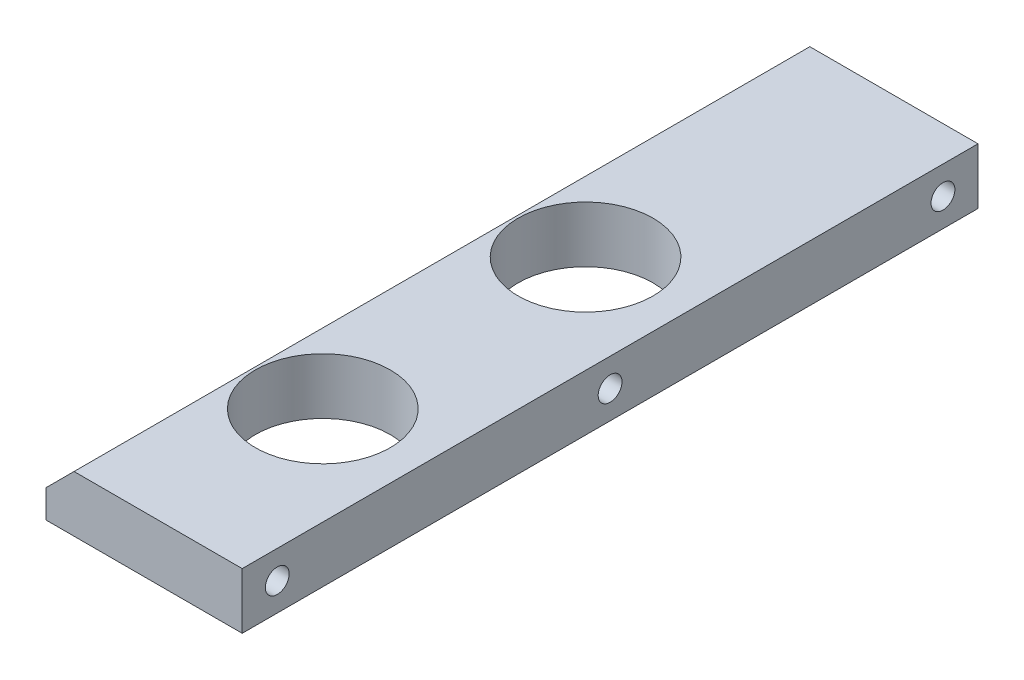
ISO-10303-21;
HEADER;
FILE_DESCRIPTION(('STEP AP214'),'2;1');
FILE_NAME('part.step','',(''),(''),'','','');
FILE_SCHEMA(('AUTOMOTIVE_DESIGN { 1 0 10303 214 1 1 1 1 }'));
ENDSEC;
DATA;
#1=APPLICATION_CONTEXT('core data for automotive mechanical design processes');
#2=APPLICATION_PROTOCOL_DEFINITION('international standard','automotive_design',2000,#1);
#3=PRODUCT_CONTEXT('',#1,'mechanical');
#4=PRODUCT('Part','Part','',(#3));
#5=PRODUCT_RELATED_PRODUCT_CATEGORY('part','',(#4));
#6=PRODUCT_DEFINITION_FORMATION('','',#4);
#7=PRODUCT_DEFINITION_CONTEXT('part definition',#1,'design');
#8=PRODUCT_DEFINITION('design','',#6,#7);
#9=PRODUCT_DEFINITION_SHAPE('','',#8);
#10=(LENGTH_UNIT() NAMED_UNIT(*) SI_UNIT(.MILLI.,.METRE.));
#11=(NAMED_UNIT(*) PLANE_ANGLE_UNIT() SI_UNIT($,.RADIAN.));
#12=(NAMED_UNIT(*) SI_UNIT($,.STERADIAN.) SOLID_ANGLE_UNIT());
#13=UNCERTAINTY_MEASURE_WITH_UNIT(LENGTH_MEASURE(1.E-05),#10,'distance_accuracy_value','');
#14=(GEOMETRIC_REPRESENTATION_CONTEXT(3) GLOBAL_UNCERTAINTY_ASSIGNED_CONTEXT((#13)) GLOBAL_UNIT_ASSIGNED_CONTEXT((#10,
#11,#12)) REPRESENTATION_CONTEXT('',''));
#15=CARTESIAN_POINT('',(0.,0.,0.));
#16=DIRECTION('',(0.,0.,1.));
#17=DIRECTION('',(1.,0.,0.));
#18=AXIS2_PLACEMENT_3D('',#15,#16,#17);
#19=CARTESIAN_POINT('',(13.0000000000337,8.,-95.));
#20=DIRECTION('',(1.,0.,0.));
#21=DIRECTION('',(0.,1.,0.));
#22=AXIS2_PLACEMENT_3D('',#19,#20,#21);
#23=CONICAL_SURFACE('',#22,3.3999999999719,1.02974425866659);
#24=CARTESIAN_POINT('',(10.9570738953551,7.99999999995293,-95.));
#25=VERTEX_POINT('',#24);
#26=VERTEX_LOOP('',#25);
#27=FACE_BOUND('',#26,.T.);
#28=CARTESIAN_POINT('',(13.,8.,-95.));
#29=DIRECTION('',(1.,0.,0.));
#30=DIRECTION('',(0.,0.,-1.));
#31=AXIS2_PLACEMENT_3D('',#28,#29,#30);
#32=CIRCLE('',#31,3.4);
#33=CARTESIAN_POINT('',(13.,8.,-98.4));
#34=VERTEX_POINT('',#33);
#35=EDGE_CURVE('E93',#34,#34,#32,.T.);
#36=ORIENTED_EDGE('',*,*,#35,.T.);
#37=EDGE_LOOP('',(#36));
#38=FACE_BOUND('',#37,.T.);
#39=ADVANCED_FACE('F17',(#27,#38),#23,.F.);
#40=CARTESIAN_POINT('',(12.9999999998631,8.,0.));
#41=DIRECTION('',(1.,0.,0.));
#42=DIRECTION('',(0.,1.,0.));
#43=AXIS2_PLACEMENT_3D('',#40,#41,#42);
#44=CONICAL_SURFACE('',#43,3.39999999982865,1.02974425858268);
#45=CARTESIAN_POINT('',(10.9570738951561,7.9999999997824,0.));
#46=VERTEX_POINT('',#45);
#47=VERTEX_LOOP('',#46);
#48=FACE_BOUND('',#47,.T.);
#49=CARTESIAN_POINT('',(13.,8.,0.));
#50=DIRECTION('',(1.,0.,0.));
#51=DIRECTION('',(0.,0.,-1.));
#52=AXIS2_PLACEMENT_3D('',#49,#50,#51);
#53=CIRCLE('',#52,3.4);
#54=CARTESIAN_POINT('',(13.,8.,-3.4));
#55=VERTEX_POINT('',#54);
#56=EDGE_CURVE('E95',#55,#55,#53,.T.);
#57=ORIENTED_EDGE('',*,*,#56,.T.);
#58=EDGE_LOOP('',(#57));
#59=FACE_BOUND('',#58,.T.);
#60=ADVANCED_FACE('F90',(#48,#59),#44,.F.);
#61=CARTESIAN_POINT('',(13.0000000000337,8.,95.));
#62=DIRECTION('',(1.,0.,0.));
#63=DIRECTION('',(0.,1.,0.));
#64=AXIS2_PLACEMENT_3D('',#61,#62,#63);
#65=CONICAL_SURFACE('',#64,3.39999999996962,1.02974425866599);
#66=CARTESIAN_POINT('',(10.9570738953266,8.00000000000978,95.));
#67=VERTEX_POINT('',#66);
#68=VERTEX_LOOP('',#67);
#69=FACE_BOUND('',#68,.T.);
#70=CARTESIAN_POINT('',(13.,8.,95.));
#71=DIRECTION('',(1.,0.,0.));
#72=DIRECTION('',(0.,0.,-1.));
#73=AXIS2_PLACEMENT_3D('',#70,#71,#72);
#74=CIRCLE('',#73,3.4);
#75=CARTESIAN_POINT('',(13.,8.,91.6));
#76=VERTEX_POINT('',#75);
#77=EDGE_CURVE('E98',#76,#76,#74,.T.);
#78=ORIENTED_EDGE('',*,*,#77,.T.);
#79=EDGE_LOOP('',(#78));
#80=FACE_BOUND('',#79,.T.);
#81=ADVANCED_FACE('F205',(#69,#80),#65,.F.);
#82=CARTESIAN_POINT('',(10.1049275901,8.,-95.));
#83=DIRECTION('',(1.,0.,0.));
#84=DIRECTION('',(0.,0.,-1.));
#85=AXIS2_PLACEMENT_3D('',#82,#83,#84);
#86=CYLINDRICAL_SURFACE('',#85,3.4);
#87=ORIENTED_EDGE('',*,*,#35,.F.);
#88=EDGE_LOOP('',(#87));
#89=FACE_BOUND('',#88,.T.);
#90=CARTESIAN_POINT('',(28.,8.,-95.));
#91=DIRECTION('',(1.,0.,0.));
#92=DIRECTION('',(0.,0.,-1.));
#93=AXIS2_PLACEMENT_3D('',#90,#91,#92);
#94=CIRCLE('',#93,3.4);
#95=CARTESIAN_POINT('',(28.,8.,-98.4));
#96=VERTEX_POINT('',#95);
#97=EDGE_CURVE('E20',#96,#96,#94,.F.);
#98=ORIENTED_EDGE('',*,*,#97,.F.);
#99=EDGE_LOOP('',(#98));
#100=FACE_BOUND('',#99,.T.);
#101=ADVANCED_FACE('F327',(#89,#100),#86,.F.);
#102=CARTESIAN_POINT('',(10.1049275901,8.,0.));
#103=DIRECTION('',(1.,0.,0.));
#104=DIRECTION('',(0.,0.,-1.));
#105=AXIS2_PLACEMENT_3D('',#102,#103,#104);
#106=CYLINDRICAL_SURFACE('',#105,3.4);
#107=ORIENTED_EDGE('',*,*,#56,.F.);
#108=EDGE_LOOP('',(#107));
#109=FACE_BOUND('',#108,.T.);
#110=CARTESIAN_POINT('',(28.,8.,0.));
#111=DIRECTION('',(1.,0.,0.));
#112=DIRECTION('',(0.,0.,-1.));
#113=AXIS2_PLACEMENT_3D('',#110,#111,#112);
#114=CIRCLE('',#113,3.4);
#115=CARTESIAN_POINT('',(28.,8.,-3.4));
#116=VERTEX_POINT('',#115);
#117=EDGE_CURVE('E128',#116,#116,#114,.F.);
#118=ORIENTED_EDGE('',*,*,#117,.F.);
#119=EDGE_LOOP('',(#118));
#120=FACE_BOUND('',#119,.T.);
#121=ADVANCED_FACE('F211',(#109,#120),#106,.F.);
#122=CARTESIAN_POINT('',(10.1049275901,8.,95.));
#123=DIRECTION('',(1.,0.,0.));
#124=DIRECTION('',(0.,0.,-1.));
#125=AXIS2_PLACEMENT_3D('',#122,#123,#124);
#126=CYLINDRICAL_SURFACE('',#125,3.4);
#127=ORIENTED_EDGE('',*,*,#77,.F.);
#128=EDGE_LOOP('',(#127));
#129=FACE_BOUND('',#128,.T.);
#130=CARTESIAN_POINT('',(28.,8.,95.));
#131=DIRECTION('',(1.,0.,0.));
#132=DIRECTION('',(0.,0.,-1.));
#133=AXIS2_PLACEMENT_3D('',#130,#131,#132);
#134=CIRCLE('',#133,3.4);
#135=CARTESIAN_POINT('',(28.,8.,91.6));
#136=VERTEX_POINT('',#135);
#137=EDGE_CURVE('E125',#136,#136,#134,.F.);
#138=ORIENTED_EDGE('',*,*,#137,.F.);
#139=EDGE_LOOP('',(#138));
#140=FACE_BOUND('',#139,.T.);
#141=ADVANCED_FACE('F207',(#129,#140),#126,.F.);
#142=CARTESIAN_POINT('',(-24.,12.,0.));
#143=DIRECTION('',(-0.707106781186548,0.707106781186548,0.));
#144=DIRECTION('',(-0.707106781186548,-0.707106781186548,0.));
#145=AXIS2_PLACEMENT_3D('',#142,#143,#144);
#146=PLANE('',#145);
#147=DIRECTION('',(0.,0.,1.));
#148=VECTOR('',#147,1.);
#149=CARTESIAN_POINT('',(-28.,8.,-105.));
#150=LINE('',#149,#148);
#151=CARTESIAN_POINT('',(-28.,8.,105.));
#152=VERTEX_POINT('',#151);
#153=CARTESIAN_POINT('',(-28.,8.,-105.));
#154=VERTEX_POINT('',#153);
#155=EDGE_CURVE('E154',#152,#154,#150,.F.);
#156=ORIENTED_EDGE('',*,*,#155,.F.);
#157=DIRECTION('',(-0.707106781186548,-0.707106781186548,0.));
#158=VECTOR('',#157,1.);
#159=CARTESIAN_POINT('',(-20.,16.,105.));
#160=LINE('',#159,#158);
#161=CARTESIAN_POINT('',(-20.,16.,105.));
#162=VERTEX_POINT('',#161);
#163=EDGE_CURVE('E142',#162,#152,#160,.T.);
#164=ORIENTED_EDGE('',*,*,#163,.F.);
#165=DIRECTION('',(0.,0.,1.));
#166=VECTOR('',#165,1.);
#167=CARTESIAN_POINT('',(-20.,16.,0.));
#168=LINE('',#167,#166);
#169=CARTESIAN_POINT('',(-20.,16.,-105.));
#170=VERTEX_POINT('',#169);
#171=EDGE_CURVE('E201',#170,#162,#168,.T.);
#172=ORIENTED_EDGE('',*,*,#171,.F.);
#173=DIRECTION('',(0.707106781186548,0.707106781186548,0.));
#174=VECTOR('',#173,1.);
#175=CARTESIAN_POINT('',(-28.,8.,-105.));
#176=LINE('',#175,#174);
#177=EDGE_CURVE('E124',#154,#170,#176,.T.);
#178=ORIENTED_EDGE('',*,*,#177,.F.);
#179=EDGE_LOOP('',(#156,#164,#172,#178));
#180=FACE_BOUND('',#179,.T.);
#181=ADVANCED_FACE('F210',(#180),#146,.T.);
#182=CARTESIAN_POINT('',(0.,16.,0.));
#183=DIRECTION('',(0.,1.,0.));
#184=DIRECTION('',(0.,0.,1.));
#185=AXIS2_PLACEMENT_3D('',#182,#183,#184);
#186=PLANE('',#185);
#187=CARTESIAN_POINT('',(0.,16.,-21.));
#188=DIRECTION('',(0.,-1.,0.));
#189=DIRECTION('',(0.,0.,-1.));
#190=AXIS2_PLACEMENT_3D('',#187,#188,#189);
#191=CIRCLE('',#190,19.25);
#192=CARTESIAN_POINT('',(0.,16.,-40.25));
#193=VERTEX_POINT('',#192);
#194=EDGE_CURVE('E117',#193,#193,#191,.T.);
#195=ORIENTED_EDGE('',*,*,#194,.T.);
#196=EDGE_LOOP('',(#195));
#197=FACE_BOUND('',#196,.T.);
#198=CARTESIAN_POINT('',(0.,16.,54.));
#199=DIRECTION('',(0.,-1.,0.));
#200=DIRECTION('',(0.,0.,-1.));
#201=AXIS2_PLACEMENT_3D('',#198,#199,#200);
#202=CIRCLE('',#201,19.25);
#203=CARTESIAN_POINT('',(0.,16.,34.75));
#204=VERTEX_POINT('',#203);
#205=EDGE_CURVE('E121',#204,#204,#202,.T.);
#206=ORIENTED_EDGE('',*,*,#205,.T.);
#207=EDGE_LOOP('',(#206));
#208=FACE_BOUND('',#207,.T.);
#209=DIRECTION('',(-1.,0.,0.));
#210=VECTOR('',#209,1.);
#211=CARTESIAN_POINT('',(28.,16.,-105.));
#212=LINE('',#211,#210);
#213=CARTESIAN_POINT('',(28.,16.,-105.));
#214=VERTEX_POINT('',#213);
#215=EDGE_CURVE('E127',#170,#214,#212,.F.);
#216=ORIENTED_EDGE('',*,*,#215,.F.);
#217=ORIENTED_EDGE('',*,*,#171,.T.);
#218=DIRECTION('',(1.,0.,0.));
#219=VECTOR('',#218,1.);
#220=CARTESIAN_POINT('',(-28.,16.,105.));
#221=LINE('',#220,#219);
#222=CARTESIAN_POINT('',(28.,16.,105.));
#223=VERTEX_POINT('',#222);
#224=EDGE_CURVE('E149',#223,#162,#221,.F.);
#225=ORIENTED_EDGE('',*,*,#224,.F.);
#226=DIRECTION('',(0.,0.,-1.));
#227=VECTOR('',#226,1.);
#228=CARTESIAN_POINT('',(28.,16.,105.));
#229=LINE('',#228,#227);
#230=EDGE_CURVE('E136',#214,#223,#229,.F.);
#231=ORIENTED_EDGE('',*,*,#230,.F.);
#232=EDGE_LOOP('',(#216,#217,#225,#231));
#233=FACE_BOUND('',#232,.T.);
#234=ADVANCED_FACE('F286',(#197,#208,#233),#186,.T.);
#235=CARTESIAN_POINT('',(-14.3,11.0000000000241,78.7));
#236=DIRECTION('',(0.,-1.,0.));
#237=DIRECTION('',(0.,0.,-1.));
#238=AXIS2_PLACEMENT_3D('',#235,#236,#237);
#239=CONICAL_SURFACE('',#238,2.49999999997154,1.02974425866932);
#240=CARTESIAN_POINT('',(-14.3,11.,78.7));
#241=DIRECTION('',(0.,-1.,0.));
#242=DIRECTION('',(0.,0.,-1.));
#243=AXIS2_PLACEMENT_3D('',#240,#241,#242);
#244=CIRCLE('',#243,2.5);
#245=CARTESIAN_POINT('',(-14.3,11.,76.2));
#246=VERTEX_POINT('',#245);
#247=EDGE_CURVE('E120',#246,#246,#244,.T.);
#248=ORIENTED_EDGE('',*,*,#247,.T.);
#249=EDGE_LOOP('',(#248));
#250=FACE_BOUND('',#249,.T.);
#251=CARTESIAN_POINT('',(-14.3000000000768,12.5021515475225,78.7));
#252=VERTEX_POINT('',#251);
#253=VERTEX_LOOP('',#252);
#254=FACE_BOUND('',#253,.T.);
#255=ADVANCED_FACE('F315',(#250,#254),#239,.F.);
#256=CARTESIAN_POINT('',(14.3,10.9999999999673,29.3));
#257=DIRECTION('',(0.,-1.,0.));
#258=DIRECTION('',(0.,0.,-1.));
#259=AXIS2_PLACEMENT_3D('',#256,#257,#258);
#260=CONICAL_SURFACE('',#259,2.50000000001983,1.02974425867857);
#261=CARTESIAN_POINT('',(14.3,11.,29.3));
#262=DIRECTION('',(0.,-1.,0.));
#263=DIRECTION('',(0.,0.,-1.));
#264=AXIS2_PLACEMENT_3D('',#261,#262,#263);
#265=CIRCLE('',#264,2.5);
#266=CARTESIAN_POINT('',(14.3,11.,26.8));
#267=VERTEX_POINT('',#266);
#268=EDGE_CURVE('E196',#267,#267,#265,.T.);
#269=ORIENTED_EDGE('',*,*,#268,.T.);
#270=EDGE_LOOP('',(#269));
#271=FACE_BOUND('',#270,.T.);
#272=CARTESIAN_POINT('',(14.30000000002,12.502151547551,29.3));
#273=VERTEX_POINT('',#272);
#274=VERTEX_LOOP('',#273);
#275=FACE_BOUND('',#274,.T.);
#276=ADVANCED_FACE('F309',(#271,#275),#260,.F.);
#277=CARTESIAN_POINT('',(14.3,11.0000000000809,-45.7));
#278=DIRECTION('',(0.,-1.,0.));
#279=DIRECTION('',(0.,0.,-1.));
#280=AXIS2_PLACEMENT_3D('',#277,#278,#279);
#281=CONICAL_SURFACE('',#280,2.49999999978108,1.02974425852182);
#282=CARTESIAN_POINT('',(14.3,11.,-45.7));
#283=DIRECTION('',(0.,-1.,0.));
#284=DIRECTION('',(0.,0.,-1.));
#285=AXIS2_PLACEMENT_3D('',#282,#283,#284);
#286=CIRCLE('',#285,2.5);
#287=CARTESIAN_POINT('',(14.3,11.,-48.2));
#288=VERTEX_POINT('',#287);
#289=EDGE_CURVE('E161',#288,#288,#286,.T.);
#290=ORIENTED_EDGE('',*,*,#289,.T.);
#291=EDGE_LOOP('',(#290));
#292=FACE_BOUND('',#291,.T.);
#293=CARTESIAN_POINT('',(14.2999999997357,12.5021515476362,-45.7));
#294=VERTEX_POINT('',#293);
#295=VERTEX_LOOP('',#294);
#296=FACE_BOUND('',#295,.T.);
#297=ADVANCED_FACE('F300',(#292,#296),#281,.F.);
#298=CARTESIAN_POINT('',(-14.3,11.0000000000809,3.7));
#299=DIRECTION('',(0.,-1.,0.));
#300=DIRECTION('',(0.,0.,-1.));
#301=AXIS2_PLACEMENT_3D('',#298,#299,#300);
#302=CONICAL_SURFACE('',#301,2.50000000003529,1.02974425868861);
#303=CARTESIAN_POINT('',(-11.799999999983,11.0000000000241,3.7));
#304=CARTESIAN_POINT('',(-11.9041666666658,11.0625896478075,3.69999999999947));
#305=CARTESIAN_POINT('',(-12.0083333333299,11.1251792956221,3.69999999999901));
#306=CARTESIAN_POINT('',(-12.2166666666581,11.2503585912702,3.69999999999822));
#307=CARTESIAN_POINT('',(-12.3208333333222,11.3129482391038,3.69999999999789));
#308=CARTESIAN_POINT('',(-12.5291666666627,11.4381275347313,3.69999999999736));
#309=CARTESIAN_POINT('',(-12.6333333333392,11.5007171825252,3.69999999999717));
#310=CARTESIAN_POINT('',(-12.841666666676,11.625896478159,3.6999999999969));
#311=CARTESIAN_POINT('',(-12.9458333333363,11.6884861259988,3.69999999999684));
#312=CARTESIAN_POINT('',(-13.1541666666759,11.813665421628,3.69999999999684));
#313=CARTESIAN_POINT('',(-13.2583333333551,11.8762550694174,3.6999999999969));
#314=CARTESIAN_POINT('',(-13.4666666666735,12.0014343650503,3.69999999999717));
#315=CARTESIAN_POINT('',(-13.5708333333126,12.0640240128939,3.69999999999736));
#316=CARTESIAN_POINT('',(-13.7791666666271,12.1892033085332,3.69999999999789));
#317=CARTESIAN_POINT('',(-13.8833333333026,12.2517929563288,3.69999999999822));
#318=CARTESIAN_POINT('',(-14.0916666666536,12.3769722519391,3.69999999999901));
#319=CARTESIAN_POINT('',(-14.195833333329,12.4395618997536,3.69999999999947));
#320=CARTESIAN_POINT('',(-14.2999999999807,12.5021515476078,3.7));
#321=B_SPLINE_CURVE_WITH_KNOTS('',3,(#303,#304,#305,#306,#307,#308,#309,#310,#311,#312,#313,
#314,#315,#316,#317,#318,#319,#320),.UNSPECIFIED.,.F.,.F.,(4,2,2,2,2,2,2,2,4),(0.,
0.364572936621953,0.729145873273182,1.09371880989513,1.45829174654636,1.82286468316832,
2.18743761977082,2.55201055639277,2.916583493044),.UNSPECIFIED.);
#322=CARTESIAN_POINT('',(-11.7999999999957,11.000000000006,3.7));
#323=VERTEX_POINT('',#322);
#324=CARTESIAN_POINT('',(-14.3,12.5021515476078,3.7));
#325=VERTEX_POINT('',#324);
#326=EDGE_CURVE('E156',#323,#325,#321,.T.);
#327=ORIENTED_EDGE('',*,*,#326,.T.);
#328=CARTESIAN_POINT('',(-14.3000000000193,12.5021515476078,3.7));
#329=CARTESIAN_POINT('',(-14.404166666671,12.4395618997536,3.69999999999947));
#330=CARTESIAN_POINT('',(-14.5083333333464,12.3769722519391,3.69999999999901));
#331=CARTESIAN_POINT('',(-14.7166666666974,12.2517929563288,3.69999999999822));
#332=CARTESIAN_POINT('',(-14.8208333333729,12.1892033085332,3.69999999999789));
#333=CARTESIAN_POINT('',(-15.0291666666874,12.0640240128939,3.69999999999736));
#334=CARTESIAN_POINT('',(-15.1333333333265,12.0014343650503,3.69999999999717));
#335=CARTESIAN_POINT('',(-15.3416666666449,11.8762550694174,3.6999999999969));
#336=CARTESIAN_POINT('',(-15.4458333333241,11.813665421628,3.69999999999684));
#337=CARTESIAN_POINT('',(-15.6541666666637,11.6884861259988,3.69999999999684));
#338=CARTESIAN_POINT('',(-15.758333333324,11.625896478159,3.6999999999969));
#339=CARTESIAN_POINT('',(-15.9666666666608,11.5007171825252,3.69999999999717));
#340=CARTESIAN_POINT('',(-16.0708333333373,11.4381275347313,3.69999999999737));
#341=CARTESIAN_POINT('',(-16.2791666666778,11.3129482391038,3.69999999999789));
#342=CARTESIAN_POINT('',(-16.3833333333419,11.2503585912702,3.69999999999822));
#343=CARTESIAN_POINT('',(-16.5916666666701,11.1251792956221,3.69999999999901));
#344=CARTESIAN_POINT('',(-16.6958333333342,11.0625896478075,3.69999999999947));
#345=CARTESIAN_POINT('',(-16.800000000017,11.0000000000241,3.7));
#346=B_SPLINE_CURVE_WITH_KNOTS('',3,(#328,#329,#330,#331,#332,#333,#334,#335,#336,#337,#338,
#339,#340,#341,#342,#343,#344,#345),.UNSPECIFIED.,.F.,.F.,(4,2,2,2,2,2,2,2,4),(0.,
0.364572936651229,0.729145873273182,1.09371880987569,1.45829174649764,1.82286468314887,
2.18743761977082,2.55201055642205,2.91658349304401),.UNSPECIFIED.);
#347=CARTESIAN_POINT('',(-16.8000000000042,11.000000000006,3.7));
#348=VERTEX_POINT('',#347);
#349=EDGE_CURVE('E171',#325,#348,#346,.T.);
#350=ORIENTED_EDGE('',*,*,#349,.T.);
#351=CARTESIAN_POINT('',(-14.3,11.,3.7));
#352=DIRECTION('',(0.,-1.,0.));
#353=DIRECTION('',(0.,0.,-1.));
#354=AXIS2_PLACEMENT_3D('',#351,#352,#353);
#355=CIRCLE('',#354,2.5);
#356=EDGE_CURVE('E157',#348,#323,#355,.T.);
#357=ORIENTED_EDGE('',*,*,#356,.T.);
#358=EDGE_LOOP('',(#327,#350,#357));
#359=FACE_BOUND('',#358,.T.);
#360=ADVANCED_FACE('F295',(#359),#302,.F.);
#361=CARTESIAN_POINT('',(-14.3,11.0000000000241,3.7));
#362=DIRECTION('',(0.,-1.,0.));
#363=DIRECTION('',(0.,0.,-1.));
#364=AXIS2_PLACEMENT_3D('',#361,#362,#363);
#365=CONICAL_SURFACE('',#364,2.50000000001701,1.0297442586719);
#366=CARTESIAN_POINT('',(-14.3,11.,3.7));
#367=DIRECTION('',(0.,-1.,0.));
#368=DIRECTION('',(0.,0.,-1.));
#369=AXIS2_PLACEMENT_3D('',#366,#367,#368);
#370=CIRCLE('',#369,2.5);
#371=EDGE_CURVE('E160',#323,#348,#370,.T.);
#372=ORIENTED_EDGE('',*,*,#371,.T.);
#373=ORIENTED_EDGE('',*,*,#349,.F.);
#374=ORIENTED_EDGE('',*,*,#326,.F.);
#375=EDGE_LOOP('',(#372,#373,#374));
#376=FACE_BOUND('',#375,.T.);
#377=ADVANCED_FACE('F179',(#376),#365,.F.);
#378=CARTESIAN_POINT('',(-28.,0.,-105.));
#379=DIRECTION('',(-1.,0.,0.));
#380=DIRECTION('',(0.,0.,1.));
#381=AXIS2_PLACEMENT_3D('',#378,#379,#380);
#382=PLANE('',#381);
#383=DIRECTION('',(0.,1.,0.));
#384=VECTOR('',#383,1.);
#385=CARTESIAN_POINT('',(-28.,0.,105.));
#386=LINE('',#385,#384);
#387=CARTESIAN_POINT('',(-28.,0.,105.));
#388=VERTEX_POINT('',#387);
#389=EDGE_CURVE('E152',#152,#388,#386,.F.);
#390=ORIENTED_EDGE('',*,*,#389,.F.);
#391=ORIENTED_EDGE('',*,*,#155,.T.);
#392=DIRECTION('',(0.,1.,0.));
#393=VECTOR('',#392,1.);
#394=CARTESIAN_POINT('',(-28.,0.,-105.));
#395=LINE('',#394,#393);
#396=CARTESIAN_POINT('',(-28.,0.,-105.));
#397=VERTEX_POINT('',#396);
#398=EDGE_CURVE('E279',#397,#154,#395,.T.);
#399=ORIENTED_EDGE('',*,*,#398,.F.);
#400=DIRECTION('',(0.,0.,1.));
#401=VECTOR('',#400,1.);
#402=CARTESIAN_POINT('',(-28.,0.,0.));
#403=LINE('',#402,#401);
#404=EDGE_CURVE('E166',#397,#388,#403,.T.);
#405=ORIENTED_EDGE('',*,*,#404,.T.);
#406=EDGE_LOOP('',(#390,#391,#399,#405));
#407=FACE_BOUND('',#406,.T.);
#408=ADVANCED_FACE('F177',(#407),#382,.T.);
#409=CARTESIAN_POINT('',(-28.,0.,105.));
#410=DIRECTION('',(0.,0.,1.));
#411=DIRECTION('',(1.,0.,0.));
#412=AXIS2_PLACEMENT_3D('',#409,#410,#411);
#413=PLANE('',#412);
#414=ORIENTED_EDGE('',*,*,#224,.T.);
#415=ORIENTED_EDGE('',*,*,#163,.T.);
#416=ORIENTED_EDGE('',*,*,#389,.T.);
#417=DIRECTION('',(1.,0.,0.));
#418=VECTOR('',#417,1.);
#419=CARTESIAN_POINT('',(0.,0.,105.));
#420=LINE('',#419,#418);
#421=CARTESIAN_POINT('',(28.,0.,105.));
#422=VERTEX_POINT('',#421);
#423=EDGE_CURVE('E269',#388,#422,#420,.T.);
#424=ORIENTED_EDGE('',*,*,#423,.T.);
#425=DIRECTION('',(0.,1.,0.));
#426=VECTOR('',#425,1.);
#427=CARTESIAN_POINT('',(28.,0.,105.));
#428=LINE('',#427,#426);
#429=EDGE_CURVE('E133',#223,#422,#428,.F.);
#430=ORIENTED_EDGE('',*,*,#429,.F.);
#431=EDGE_LOOP('',(#414,#415,#416,#424,#430));
#432=FACE_BOUND('',#431,.T.);
#433=ADVANCED_FACE('F218',(#432),#413,.T.);
#434=CARTESIAN_POINT('',(28.,0.,105.));
#435=DIRECTION('',(1.,0.,0.));
#436=DIRECTION('',(0.,0.,-1.));
#437=AXIS2_PLACEMENT_3D('',#434,#435,#436);
#438=PLANE('',#437);
#439=ORIENTED_EDGE('',*,*,#137,.T.);
#440=EDGE_LOOP('',(#439));
#441=FACE_BOUND('',#440,.T.);
#442=ORIENTED_EDGE('',*,*,#117,.T.);
#443=EDGE_LOOP('',(#442));
#444=FACE_BOUND('',#443,.T.);
#445=ORIENTED_EDGE('',*,*,#97,.T.);
#446=EDGE_LOOP('',(#445));
#447=FACE_BOUND('',#446,.T.);
#448=ORIENTED_EDGE('',*,*,#429,.T.);
#449=DIRECTION('',(0.,0.,1.));
#450=VECTOR('',#449,1.);
#451=CARTESIAN_POINT('',(28.,0.,0.));
#452=LINE('',#451,#450);
#453=CARTESIAN_POINT('',(28.,0.,-105.));
#454=VERTEX_POINT('',#453);
#455=EDGE_CURVE('E267',#422,#454,#452,.F.);
#456=ORIENTED_EDGE('',*,*,#455,.T.);
#457=DIRECTION('',(0.,1.,0.));
#458=VECTOR('',#457,1.);
#459=CARTESIAN_POINT('',(28.,0.,-105.));
#460=LINE('',#459,#458);
#461=EDGE_CURVE('E35',#214,#454,#460,.F.);
#462=ORIENTED_EDGE('',*,*,#461,.F.);
#463=ORIENTED_EDGE('',*,*,#230,.T.);
#464=EDGE_LOOP('',(#448,#456,#462,#463));
#465=FACE_BOUND('',#464,.T.);
#466=ADVANCED_FACE('F215',(#441,#444,#447,#465),#438,.T.);
#467=CARTESIAN_POINT('',(28.,0.,-105.));
#468=DIRECTION('',(0.,0.,-1.));
#469=DIRECTION('',(-1.,0.,0.));
#470=AXIS2_PLACEMENT_3D('',#467,#468,#469);
#471=PLANE('',#470);
#472=ORIENTED_EDGE('',*,*,#398,.T.);
#473=ORIENTED_EDGE('',*,*,#177,.T.);
#474=ORIENTED_EDGE('',*,*,#215,.T.);
#475=ORIENTED_EDGE('',*,*,#461,.T.);
#476=DIRECTION('',(1.,0.,0.));
#477=VECTOR('',#476,1.);
#478=CARTESIAN_POINT('',(0.,0.,-105.));
#479=LINE('',#478,#477);
#480=EDGE_CURVE('E116',#454,#397,#479,.F.);
#481=ORIENTED_EDGE('',*,*,#480,.T.);
#482=EDGE_LOOP('',(#472,#473,#474,#475,#481));
#483=FACE_BOUND('',#482,.T.);
#484=ADVANCED_FACE('F217',(#483),#471,.T.);
#485=CARTESIAN_POINT('',(0.,16.,54.));
#486=DIRECTION('',(0.,-1.,0.));
#487=DIRECTION('',(0.,0.,-1.));
#488=AXIS2_PLACEMENT_3D('',#485,#486,#487);
#489=CYLINDRICAL_SURFACE('',#488,19.25);
#490=ORIENTED_EDGE('',*,*,#205,.F.);
#491=EDGE_LOOP('',(#490));
#492=FACE_BOUND('',#491,.T.);
#493=CARTESIAN_POINT('',(0.,0.,54.));
#494=DIRECTION('',(0.,-1.,0.));
#495=DIRECTION('',(0.,0.,-1.));
#496=AXIS2_PLACEMENT_3D('',#493,#494,#495);
#497=CIRCLE('',#496,19.25);
#498=CARTESIAN_POINT('',(0.,0.,34.75));
#499=VERTEX_POINT('',#498);
#500=EDGE_CURVE('E113',#499,#499,#497,.T.);
#501=ORIENTED_EDGE('',*,*,#500,.T.);
#502=EDGE_LOOP('',(#501));
#503=FACE_BOUND('',#502,.T.);
#504=ADVANCED_FACE('F225',(#492,#503),#489,.F.);
#505=CARTESIAN_POINT('',(0.,16.,-21.));
#506=DIRECTION('',(0.,-1.,0.));
#507=DIRECTION('',(0.,0.,-1.));
#508=AXIS2_PLACEMENT_3D('',#505,#506,#507);
#509=CYLINDRICAL_SURFACE('',#508,19.25);
#510=ORIENTED_EDGE('',*,*,#194,.F.);
#511=EDGE_LOOP('',(#510));
#512=FACE_BOUND('',#511,.T.);
#513=CARTESIAN_POINT('',(0.,0.,-21.));
#514=DIRECTION('',(0.,-1.,0.));
#515=DIRECTION('',(0.,0.,-1.));
#516=AXIS2_PLACEMENT_3D('',#513,#514,#515);
#517=CIRCLE('',#516,19.25);
#518=CARTESIAN_POINT('',(0.,0.,-40.25));
#519=VERTEX_POINT('',#518);
#520=EDGE_CURVE('E110',#519,#519,#517,.T.);
#521=ORIENTED_EDGE('',*,*,#520,.T.);
#522=EDGE_LOOP('',(#521));
#523=FACE_BOUND('',#522,.T.);
#524=ADVANCED_FACE('F252',(#512,#523),#509,.F.);
#525=CARTESIAN_POINT('',(-14.3,13.1272591249,78.7));
#526=DIRECTION('',(0.,-1.,0.));
#527=DIRECTION('',(0.,0.,-1.));
#528=AXIS2_PLACEMENT_3D('',#525,#526,#527);
#529=CYLINDRICAL_SURFACE('',#528,2.5);
#530=ORIENTED_EDGE('',*,*,#247,.F.);
#531=EDGE_LOOP('',(#530));
#532=FACE_BOUND('',#531,.T.);
#533=CARTESIAN_POINT('',(-14.3,0.,78.7));
#534=DIRECTION('',(0.,-1.,0.));
#535=DIRECTION('',(0.,0.,-1.));
#536=AXIS2_PLACEMENT_3D('',#533,#534,#535);
#537=CIRCLE('',#536,2.5);
#538=CARTESIAN_POINT('',(-14.3,0.,76.2));
#539=VERTEX_POINT('',#538);
#540=EDGE_CURVE('E107',#539,#539,#537,.T.);
#541=ORIENTED_EDGE('',*,*,#540,.T.);
#542=EDGE_LOOP('',(#541));
#543=FACE_BOUND('',#542,.T.);
#544=ADVANCED_FACE('F248',(#532,#543),#529,.F.);
#545=CARTESIAN_POINT('',(14.3,13.1272591249,29.3));
#546=DIRECTION('',(0.,-1.,0.));
#547=DIRECTION('',(0.,0.,-1.));
#548=AXIS2_PLACEMENT_3D('',#545,#546,#547);
#549=CYLINDRICAL_SURFACE('',#548,2.5);
#550=ORIENTED_EDGE('',*,*,#268,.F.);
#551=EDGE_LOOP('',(#550));
#552=FACE_BOUND('',#551,.T.);
#553=CARTESIAN_POINT('',(14.3,0.,29.3));
#554=DIRECTION('',(0.,-1.,0.));
#555=DIRECTION('',(0.,0.,-1.));
#556=AXIS2_PLACEMENT_3D('',#553,#554,#555);
#557=CIRCLE('',#556,2.5);
#558=CARTESIAN_POINT('',(14.3,0.,26.8));
#559=VERTEX_POINT('',#558);
#560=EDGE_CURVE('E104',#559,#559,#557,.T.);
#561=ORIENTED_EDGE('',*,*,#560,.T.);
#562=EDGE_LOOP('',(#561));
#563=FACE_BOUND('',#562,.T.);
#564=ADVANCED_FACE('F244',(#552,#563),#549,.F.);
#565=CARTESIAN_POINT('',(14.3,13.1272591249,-45.7));
#566=DIRECTION('',(0.,-1.,0.));
#567=DIRECTION('',(0.,0.,-1.));
#568=AXIS2_PLACEMENT_3D('',#565,#566,#567);
#569=CYLINDRICAL_SURFACE('',#568,2.5);
#570=ORIENTED_EDGE('',*,*,#289,.F.);
#571=EDGE_LOOP('',(#570));
#572=FACE_BOUND('',#571,.T.);
#573=CARTESIAN_POINT('',(14.3,0.,-45.7));
#574=DIRECTION('',(0.,-1.,0.));
#575=DIRECTION('',(0.,0.,-1.));
#576=AXIS2_PLACEMENT_3D('',#573,#574,#575);
#577=CIRCLE('',#576,2.5);
#578=CARTESIAN_POINT('',(14.3,0.,-48.2));
#579=VERTEX_POINT('',#578);
#580=EDGE_CURVE('E26',#579,#579,#577,.T.);
#581=ORIENTED_EDGE('',*,*,#580,.T.);
#582=EDGE_LOOP('',(#581));
#583=FACE_BOUND('',#582,.T.);
#584=ADVANCED_FACE('F236',(#572,#583),#569,.F.);
#585=CARTESIAN_POINT('',(-14.3,13.1272591249,3.7));
#586=DIRECTION('',(0.,-1.,0.));
#587=DIRECTION('',(0.,0.,-1.));
#588=AXIS2_PLACEMENT_3D('',#585,#586,#587);
#589=CYLINDRICAL_SURFACE('',#588,2.5);
#590=ORIENTED_EDGE('',*,*,#371,.F.);
#591=ORIENTED_EDGE('',*,*,#356,.F.);
#592=EDGE_LOOP('',(#590,#591));
#593=FACE_BOUND('',#592,.T.);
#594=CARTESIAN_POINT('',(-14.3,0.,3.7));
#595=DIRECTION('',(0.,-1.,0.));
#596=DIRECTION('',(0.,0.,-1.));
#597=AXIS2_PLACEMENT_3D('',#594,#595,#596);
#598=CIRCLE('',#597,2.5);
#599=CARTESIAN_POINT('',(-14.3,0.,1.2));
#600=VERTEX_POINT('',#599);
#601=EDGE_CURVE('E11',#600,#600,#598,.T.);
#602=ORIENTED_EDGE('',*,*,#601,.T.);
#603=EDGE_LOOP('',(#602));
#604=FACE_BOUND('',#603,.T.);
#605=ADVANCED_FACE('F230',(#593,#604),#589,.F.);
#606=CARTESIAN_POINT('',(0.,0.,0.));
#607=DIRECTION('',(0.,1.,0.));
#608=DIRECTION('',(0.,0.,1.));
#609=AXIS2_PLACEMENT_3D('',#606,#607,#608);
#610=PLANE('',#609);
#611=ORIENTED_EDGE('',*,*,#601,.F.);
#612=EDGE_LOOP('',(#611));
#613=FACE_BOUND('',#612,.T.);
#614=ORIENTED_EDGE('',*,*,#580,.F.);
#615=EDGE_LOOP('',(#614));
#616=FACE_BOUND('',#615,.T.);
#617=ORIENTED_EDGE('',*,*,#560,.F.);
#618=EDGE_LOOP('',(#617));
#619=FACE_BOUND('',#618,.T.);
#620=ORIENTED_EDGE('',*,*,#540,.F.);
#621=EDGE_LOOP('',(#620));
#622=FACE_BOUND('',#621,.T.);
#623=ORIENTED_EDGE('',*,*,#520,.F.);
#624=EDGE_LOOP('',(#623));
#625=FACE_BOUND('',#624,.T.);
#626=ORIENTED_EDGE('',*,*,#500,.F.);
#627=EDGE_LOOP('',(#626));
#628=FACE_BOUND('',#627,.T.);
#629=ORIENTED_EDGE('',*,*,#455,.F.);
#630=ORIENTED_EDGE('',*,*,#423,.F.);
#631=ORIENTED_EDGE('',*,*,#404,.F.);
#632=ORIENTED_EDGE('',*,*,#480,.F.);
#633=EDGE_LOOP('',(#629,#630,#631,#632));
#634=FACE_BOUND('',#633,.T.);
#635=ADVANCED_FACE('F228',(#613,#616,#619,#622,#625,#628,#634),#610,.F.);
#636=CLOSED_SHELL('',(#39,#60,#81,#101,#121,#141,#181,#234,#255,#276,#297,#360,#377,#408,#433,
#466,#484,#504,#524,#544,#564,#584,#605,#635));
#637=MANIFOLD_SOLID_BREP('B1',#636);
#638=ADVANCED_BREP_SHAPE_REPRESENTATION('',(#18,#637),#14);
#639=SHAPE_DEFINITION_REPRESENTATION(#9,#638);
ENDSEC;
END-ISO-10303-21;
